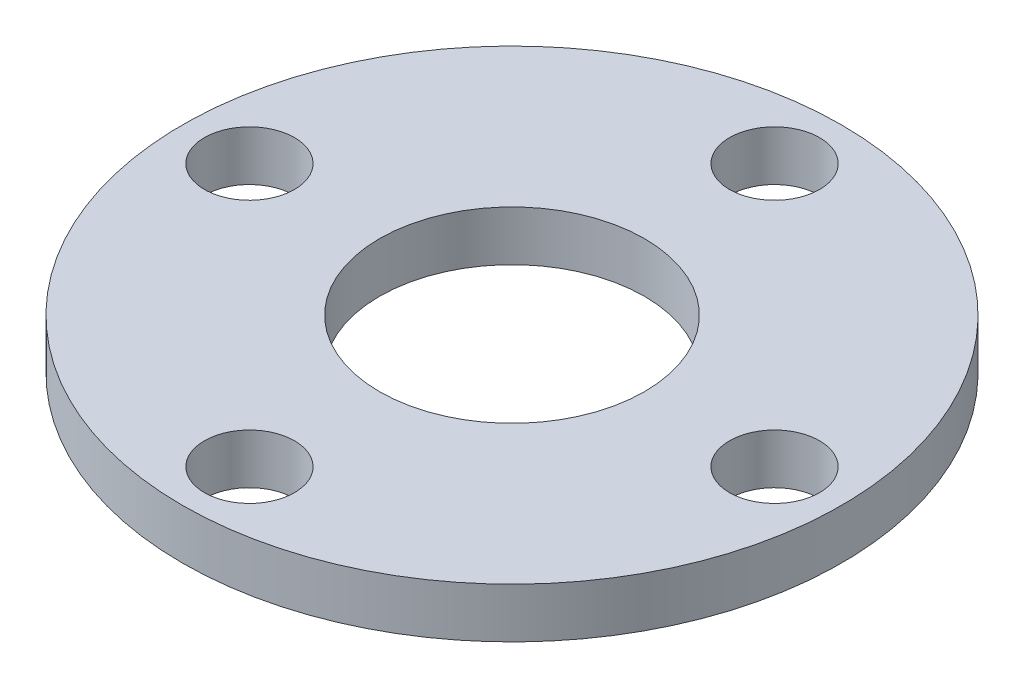
ISO-10303-21;
HEADER;
FILE_DESCRIPTION(('STEP AP214'),'2;1');
FILE_NAME('part.step','',(''),(''),'','','');
FILE_SCHEMA(('AUTOMOTIVE_DESIGN { 1 0 10303 214 1 1 1 1 }'));
ENDSEC;
DATA;
#1=APPLICATION_CONTEXT('core data for automotive mechanical design processes');
#2=APPLICATION_PROTOCOL_DEFINITION('international standard','automotive_design',2000,#1);
#3=PRODUCT_CONTEXT('',#1,'mechanical');
#4=PRODUCT('Part','Part','',(#3));
#5=PRODUCT_RELATED_PRODUCT_CATEGORY('part','',(#4));
#6=PRODUCT_DEFINITION_FORMATION('','',#4);
#7=PRODUCT_DEFINITION_CONTEXT('part definition',#1,'design');
#8=PRODUCT_DEFINITION('design','',#6,#7);
#9=PRODUCT_DEFINITION_SHAPE('','',#8);
#10=(LENGTH_UNIT() NAMED_UNIT(*) SI_UNIT(.MILLI.,.METRE.));
#11=(NAMED_UNIT(*) PLANE_ANGLE_UNIT() SI_UNIT($,.RADIAN.));
#12=(NAMED_UNIT(*) SI_UNIT($,.STERADIAN.) SOLID_ANGLE_UNIT());
#13=UNCERTAINTY_MEASURE_WITH_UNIT(LENGTH_MEASURE(1.E-05),#10,'distance_accuracy_value','');
#14=(GEOMETRIC_REPRESENTATION_CONTEXT(3) GLOBAL_UNCERTAINTY_ASSIGNED_CONTEXT((#13)) GLOBAL_UNIT_ASSIGNED_CONTEXT((#10,
#11,#12)) REPRESENTATION_CONTEXT('',''));
#15=CARTESIAN_POINT('',(0.,0.,0.));
#16=DIRECTION('',(0.,0.,1.));
#17=DIRECTION('',(1.,0.,0.));
#18=AXIS2_PLACEMENT_3D('',#15,#16,#17);
#19=CARTESIAN_POINT('',(0.,2.,0.));
#20=DIRECTION('',(0.,1.,0.));
#21=DIRECTION('',(0.,0.,1.));
#22=AXIS2_PLACEMENT_3D('',#19,#20,#21);
#23=PLANE('',#22);
#24=CARTESIAN_POINT('',(1.09981662173559E-13,2.,10.5));
#25=DIRECTION('',(0.,1.,0.));
#26=DIRECTION('',(-1.,0.,0.));
#27=AXIS2_PLACEMENT_3D('',#24,#25,#26);
#28=CIRCLE('',#27,1.8);
#29=CARTESIAN_POINT('',(-1.79999999999989,2.,10.5));
#30=VERTEX_POINT('',#29);
#31=EDGE_CURVE('E68',#30,#30,#28,.T.);
#32=ORIENTED_EDGE('',*,*,#31,.F.);
#33=EDGE_LOOP('',(#32));
#34=FACE_BOUND('',#33,.T.);
#35=CARTESIAN_POINT('',(-10.5,2.,0.));
#36=DIRECTION('',(0.,1.,0.));
#37=DIRECTION('',(0.,0.,-1.));
#38=AXIS2_PLACEMENT_3D('',#35,#36,#37);
#39=CIRCLE('',#38,1.8);
#40=CARTESIAN_POINT('',(-10.5,2.,-1.8));
#41=VERTEX_POINT('',#40);
#42=EDGE_CURVE('E62',#41,#41,#39,.T.);
#43=ORIENTED_EDGE('',*,*,#42,.F.);
#44=EDGE_LOOP('',(#43));
#45=FACE_BOUND('',#44,.T.);
#46=CARTESIAN_POINT('',(0.,2.,-10.5));
#47=DIRECTION('',(0.,1.,0.));
#48=DIRECTION('',(1.,0.,0.));
#49=AXIS2_PLACEMENT_3D('',#46,#47,#48);
#50=CIRCLE('',#49,1.8);
#51=CARTESIAN_POINT('',(1.79999999999996,2.,-10.5));
#52=VERTEX_POINT('',#51);
#53=EDGE_CURVE('E56',#52,#52,#50,.T.);
#54=ORIENTED_EDGE('',*,*,#53,.F.);
#55=EDGE_LOOP('',(#54));
#56=FACE_BOUND('',#55,.T.);
#57=CARTESIAN_POINT('',(10.5,2.,0.));
#58=DIRECTION('',(0.,1.,0.));
#59=DIRECTION('',(0.,0.,1.));
#60=AXIS2_PLACEMENT_3D('',#57,#58,#59);
#61=CIRCLE('',#60,1.8);
#62=CARTESIAN_POINT('',(10.5,2.,1.8));
#63=VERTEX_POINT('',#62);
#64=EDGE_CURVE('E50',#63,#63,#61,.T.);
#65=ORIENTED_EDGE('',*,*,#64,.F.);
#66=EDGE_LOOP('',(#65));
#67=FACE_BOUND('',#66,.T.);
#68=CARTESIAN_POINT('',(0.,2.,0.));
#69=DIRECTION('',(0.,1.,0.));
#70=DIRECTION('',(0.,0.,1.));
#71=AXIS2_PLACEMENT_3D('',#68,#69,#70);
#72=CIRCLE('',#71,13.18);
#73=CARTESIAN_POINT('',(0.,2.,13.18));
#74=VERTEX_POINT('',#73);
#75=EDGE_CURVE('E10',#74,#74,#72,.T.);
#76=ORIENTED_EDGE('',*,*,#75,.T.);
#77=EDGE_LOOP('',(#76));
#78=FACE_BOUND('',#77,.T.);
#79=CARTESIAN_POINT('',(0.,2.,0.));
#80=DIRECTION('',(0.,1.,0.));
#81=DIRECTION('',(0.,0.,1.));
#82=AXIS2_PLACEMENT_3D('',#79,#80,#81);
#83=CIRCLE('',#82,5.3);
#84=CARTESIAN_POINT('',(0.,2.,5.3));
#85=VERTEX_POINT('',#84);
#86=EDGE_CURVE('E42',#85,#85,#83,.T.);
#87=ORIENTED_EDGE('',*,*,#86,.F.);
#88=EDGE_LOOP('',(#87));
#89=FACE_BOUND('',#88,.T.);
#90=ADVANCED_FACE('F31',(#34,#45,#56,#67,#78,#89),#23,.T.);
#91=CARTESIAN_POINT('',(0.,0.,0.));
#92=DIRECTION('',(0.,1.,0.));
#93=DIRECTION('',(0.,0.,1.));
#94=AXIS2_PLACEMENT_3D('',#91,#92,#93);
#95=PLANE('',#94);
#96=CARTESIAN_POINT('',(1.09981662173559E-13,0.,10.5));
#97=DIRECTION('',(0.,1.,0.));
#98=DIRECTION('',(-1.,0.,0.));
#99=AXIS2_PLACEMENT_3D('',#96,#97,#98);
#100=CIRCLE('',#99,1.8);
#101=CARTESIAN_POINT('',(-1.79999999999989,0.,10.5));
#102=VERTEX_POINT('',#101);
#103=EDGE_CURVE('E65',#102,#102,#100,.T.);
#104=ORIENTED_EDGE('',*,*,#103,.T.);
#105=EDGE_LOOP('',(#104));
#106=FACE_BOUND('',#105,.T.);
#107=CARTESIAN_POINT('',(-10.5,0.,0.));
#108=DIRECTION('',(0.,1.,0.));
#109=DIRECTION('',(0.,0.,-1.));
#110=AXIS2_PLACEMENT_3D('',#107,#108,#109);
#111=CIRCLE('',#110,1.8);
#112=CARTESIAN_POINT('',(-10.5,0.,-1.8));
#113=VERTEX_POINT('',#112);
#114=EDGE_CURVE('E59',#113,#113,#111,.T.);
#115=ORIENTED_EDGE('',*,*,#114,.T.);
#116=EDGE_LOOP('',(#115));
#117=FACE_BOUND('',#116,.T.);
#118=CARTESIAN_POINT('',(0.,0.,-10.5));
#119=DIRECTION('',(0.,1.,0.));
#120=DIRECTION('',(1.,0.,0.));
#121=AXIS2_PLACEMENT_3D('',#118,#119,#120);
#122=CIRCLE('',#121,1.8);
#123=CARTESIAN_POINT('',(1.79999999999996,0.,-10.5));
#124=VERTEX_POINT('',#123);
#125=EDGE_CURVE('E53',#124,#124,#122,.T.);
#126=ORIENTED_EDGE('',*,*,#125,.T.);
#127=EDGE_LOOP('',(#126));
#128=FACE_BOUND('',#127,.T.);
#129=CARTESIAN_POINT('',(10.5,0.,0.));
#130=DIRECTION('',(0.,1.,0.));
#131=DIRECTION('',(0.,0.,1.));
#132=AXIS2_PLACEMENT_3D('',#129,#130,#131);
#133=CIRCLE('',#132,1.8);
#134=CARTESIAN_POINT('',(10.5,0.,1.8));
#135=VERTEX_POINT('',#134);
#136=EDGE_CURVE('E47',#135,#135,#133,.T.);
#137=ORIENTED_EDGE('',*,*,#136,.T.);
#138=EDGE_LOOP('',(#137));
#139=FACE_BOUND('',#138,.T.);
#140=CARTESIAN_POINT('',(0.,0.,0.));
#141=DIRECTION('',(0.,1.,0.));
#142=DIRECTION('',(0.,0.,1.));
#143=AXIS2_PLACEMENT_3D('',#140,#141,#142);
#144=CIRCLE('',#143,13.18);
#145=CARTESIAN_POINT('',(0.,0.,13.18));
#146=VERTEX_POINT('',#145);
#147=EDGE_CURVE('E35',#146,#146,#144,.T.);
#148=ORIENTED_EDGE('',*,*,#147,.F.);
#149=EDGE_LOOP('',(#148));
#150=FACE_BOUND('',#149,.T.);
#151=CARTESIAN_POINT('',(0.,0.,0.));
#152=DIRECTION('',(0.,1.,0.));
#153=DIRECTION('',(0.,0.,1.));
#154=AXIS2_PLACEMENT_3D('',#151,#152,#153);
#155=CIRCLE('',#154,5.3);
#156=CARTESIAN_POINT('',(0.,0.,5.3));
#157=VERTEX_POINT('',#156);
#158=EDGE_CURVE('E44',#157,#157,#155,.T.);
#159=ORIENTED_EDGE('',*,*,#158,.T.);
#160=EDGE_LOOP('',(#159));
#161=FACE_BOUND('',#160,.T.);
#162=ADVANCED_FACE('F74',(#106,#117,#128,#139,#150,#161),#95,.F.);
#163=CARTESIAN_POINT('',(0.,2.,0.));
#164=DIRECTION('',(0.,-1.,0.));
#165=DIRECTION('',(0.,0.,-1.));
#166=AXIS2_PLACEMENT_3D('',#163,#164,#165);
#167=CYLINDRICAL_SURFACE('',#166,13.18);
#168=ORIENTED_EDGE('',*,*,#75,.F.);
#169=EDGE_LOOP('',(#168));
#170=FACE_BOUND('',#169,.T.);
#171=ORIENTED_EDGE('',*,*,#147,.T.);
#172=EDGE_LOOP('',(#171));
#173=FACE_BOUND('',#172,.T.);
#174=ADVANCED_FACE('F33',(#170,#173),#167,.T.);
#175=CARTESIAN_POINT('',(0.,2.,0.));
#176=DIRECTION('',(0.,-1.,0.));
#177=DIRECTION('',(0.,0.,-1.));
#178=AXIS2_PLACEMENT_3D('',#175,#176,#177);
#179=CYLINDRICAL_SURFACE('',#178,5.3);
#180=ORIENTED_EDGE('',*,*,#86,.T.);
#181=EDGE_LOOP('',(#180));
#182=FACE_BOUND('',#181,.T.);
#183=ORIENTED_EDGE('',*,*,#158,.F.);
#184=EDGE_LOOP('',(#183));
#185=FACE_BOUND('',#184,.T.);
#186=ADVANCED_FACE('F95',(#182,#185),#179,.F.);
#187=CARTESIAN_POINT('',(10.5,0.,0.));
#188=DIRECTION('',(0.,1.,0.));
#189=DIRECTION('',(0.,0.,1.));
#190=AXIS2_PLACEMENT_3D('',#187,#188,#189);
#191=CYLINDRICAL_SURFACE('',#190,1.8);
#192=ORIENTED_EDGE('',*,*,#136,.F.);
#193=EDGE_LOOP('',(#192));
#194=FACE_BOUND('',#193,.T.);
#195=ORIENTED_EDGE('',*,*,#64,.T.);
#196=EDGE_LOOP('',(#195));
#197=FACE_BOUND('',#196,.T.);
#198=ADVANCED_FACE('F98',(#194,#197),#191,.F.);
#199=CARTESIAN_POINT('',(0.,0.,-10.5));
#200=DIRECTION('',(0.,1.,0.));
#201=DIRECTION('',(0.,0.,1.));
#202=AXIS2_PLACEMENT_3D('',#199,#200,#201);
#203=CYLINDRICAL_SURFACE('',#202,1.8);
#204=ORIENTED_EDGE('',*,*,#125,.F.);
#205=EDGE_LOOP('',(#204));
#206=FACE_BOUND('',#205,.T.);
#207=ORIENTED_EDGE('',*,*,#53,.T.);
#208=EDGE_LOOP('',(#207));
#209=FACE_BOUND('',#208,.T.);
#210=ADVANCED_FACE('F110',(#206,#209),#203,.F.);
#211=CARTESIAN_POINT('',(-10.5,0.,0.));
#212=DIRECTION('',(0.,1.,0.));
#213=DIRECTION('',(0.,0.,1.));
#214=AXIS2_PLACEMENT_3D('',#211,#212,#213);
#215=CYLINDRICAL_SURFACE('',#214,1.8);
#216=ORIENTED_EDGE('',*,*,#114,.F.);
#217=EDGE_LOOP('',(#216));
#218=FACE_BOUND('',#217,.T.);
#219=ORIENTED_EDGE('',*,*,#42,.T.);
#220=EDGE_LOOP('',(#219));
#221=FACE_BOUND('',#220,.T.);
#222=ADVANCED_FACE('F80',(#218,#221),#215,.F.);
#223=CARTESIAN_POINT('',(1.09981662173559E-13,0.,10.5));
#224=DIRECTION('',(0.,1.,0.));
#225=DIRECTION('',(0.,0.,1.));
#226=AXIS2_PLACEMENT_3D('',#223,#224,#225);
#227=CYLINDRICAL_SURFACE('',#226,1.8);
#228=ORIENTED_EDGE('',*,*,#103,.F.);
#229=EDGE_LOOP('',(#228));
#230=FACE_BOUND('',#229,.T.);
#231=ORIENTED_EDGE('',*,*,#31,.T.);
#232=EDGE_LOOP('',(#231));
#233=FACE_BOUND('',#232,.T.);
#234=ADVANCED_FACE('F77',(#230,#233),#227,.F.);
#235=CLOSED_SHELL('',(#90,#162,#174,#186,#198,#210,#222,#234));
#236=MANIFOLD_SOLID_BREP('B2',#235);
#237=ADVANCED_BREP_SHAPE_REPRESENTATION('',(#18,#236),#14);
#238=SHAPE_DEFINITION_REPRESENTATION(#9,#237);
ENDSEC;
END-ISO-10303-21;
